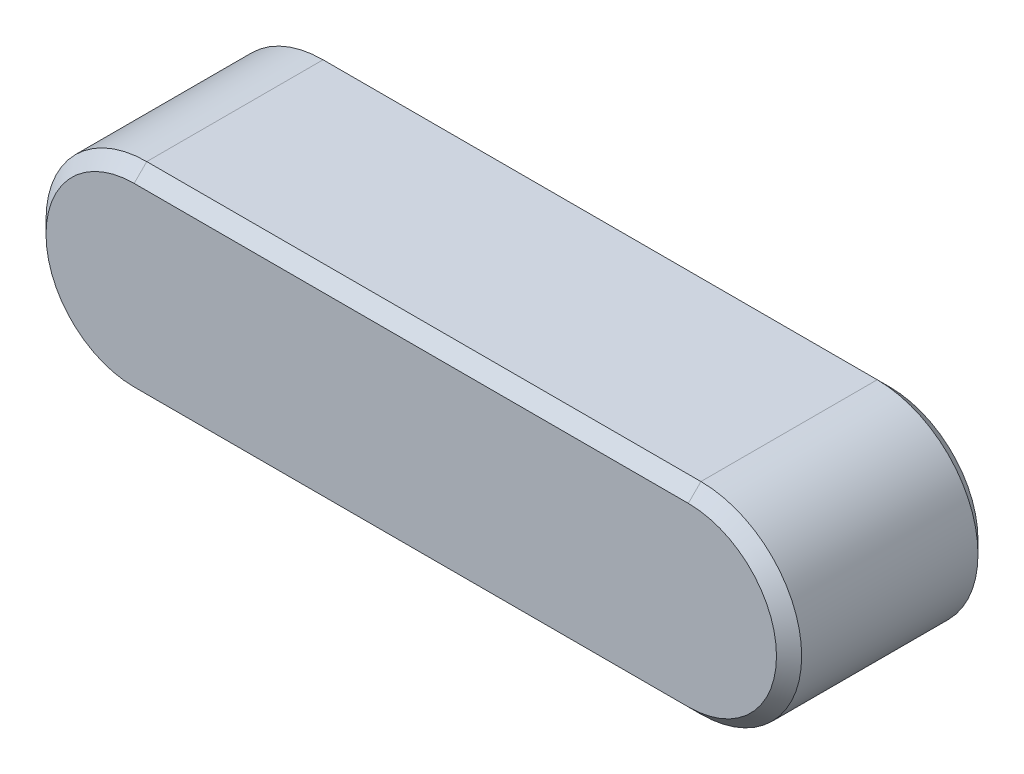
ISO-10303-21;
HEADER;
FILE_DESCRIPTION(('STEP AP214'),'2;1');
FILE_NAME('part.step','',(''),(''),'','','');
FILE_SCHEMA(('AUTOMOTIVE_DESIGN { 1 0 10303 214 1 1 1 1 }'));
ENDSEC;
DATA;
#1=APPLICATION_CONTEXT('core data for automotive mechanical design processes');
#2=APPLICATION_PROTOCOL_DEFINITION('international standard','automotive_design',2000,#1);
#3=PRODUCT_CONTEXT('',#1,'mechanical');
#4=PRODUCT('Part','Part','',(#3));
#5=PRODUCT_RELATED_PRODUCT_CATEGORY('part','',(#4));
#6=PRODUCT_DEFINITION_FORMATION('','',#4);
#7=PRODUCT_DEFINITION_CONTEXT('part definition',#1,'design');
#8=PRODUCT_DEFINITION('design','',#6,#7);
#9=PRODUCT_DEFINITION_SHAPE('','',#8);
#10=(LENGTH_UNIT() NAMED_UNIT(*) SI_UNIT(.MILLI.,.METRE.));
#11=(NAMED_UNIT(*) PLANE_ANGLE_UNIT() SI_UNIT($,.RADIAN.));
#12=(NAMED_UNIT(*) SI_UNIT($,.STERADIAN.) SOLID_ANGLE_UNIT());
#13=UNCERTAINTY_MEASURE_WITH_UNIT(LENGTH_MEASURE(1.E-05),#10,'distance_accuracy_value','');
#14=(GEOMETRIC_REPRESENTATION_CONTEXT(3) GLOBAL_UNCERTAINTY_ASSIGNED_CONTEXT((#13)) GLOBAL_UNIT_ASSIGNED_CONTEXT((#10,
#11,#12)) REPRESENTATION_CONTEXT('',''));
#15=CARTESIAN_POINT('',(0.,0.,0.));
#16=DIRECTION('',(0.,0.,1.));
#17=DIRECTION('',(1.,0.,0.));
#18=AXIS2_PLACEMENT_3D('',#15,#16,#17);
#19=CARTESIAN_POINT('',(0.,0.,8.));
#20=DIRECTION('',(0.,0.,-1.));
#21=DIRECTION('',(-1.,0.,0.));
#22=AXIS2_PLACEMENT_3D('',#19,#20,#21);
#23=CYLINDRICAL_SURFACE('',#22,4.);
#24=DIRECTION('',(0.,0.,-1.));
#25=VECTOR('',#24,1.);
#26=CARTESIAN_POINT('',(0.,4.,8.));
#27=LINE('',#26,#25);
#28=CARTESIAN_POINT('',(0.,4.,7.5));
#29=VERTEX_POINT('',#28);
#30=CARTESIAN_POINT('',(0.,4.,0.500000000000005));
#31=VERTEX_POINT('',#30);
#32=EDGE_CURVE('E169',#29,#31,#27,.T.);
#33=ORIENTED_EDGE('',*,*,#32,.T.);
#34=CARTESIAN_POINT('',(0.,0.,0.500000000000005));
#35=DIRECTION('',(0.,0.,1.));
#36=DIRECTION('',(1.,0.,0.));
#37=AXIS2_PLACEMENT_3D('',#34,#35,#36);
#38=CIRCLE('',#37,4.);
#39=CARTESIAN_POINT('',(0.,-4.,0.500000000000005));
#40=VERTEX_POINT('',#39);
#41=EDGE_CURVE('E125',#31,#40,#38,.T.);
#42=ORIENTED_EDGE('',*,*,#41,.T.);
#43=DIRECTION('',(0.,0.,-1.));
#44=VECTOR('',#43,1.);
#45=CARTESIAN_POINT('',(0.,-4.,8.));
#46=LINE('',#45,#44);
#47=CARTESIAN_POINT('',(0.,-4.,7.5));
#48=VERTEX_POINT('',#47);
#49=EDGE_CURVE('E108',#48,#40,#46,.T.);
#50=ORIENTED_EDGE('',*,*,#49,.F.);
#51=CARTESIAN_POINT('',(0.,0.,7.5));
#52=DIRECTION('',(0.,0.,1.));
#53=DIRECTION('',(1.,0.,0.));
#54=AXIS2_PLACEMENT_3D('',#51,#52,#53);
#55=CIRCLE('',#54,4.);
#56=EDGE_CURVE('E122',#48,#29,#55,.F.);
#57=ORIENTED_EDGE('',*,*,#56,.T.);
#58=EDGE_LOOP('',(#33,#42,#50,#57));
#59=FACE_BOUND('',#58,.T.);
#60=ADVANCED_FACE('F35',(#59),#23,.T.);
#61=CARTESIAN_POINT('',(0.,-4.,8.));
#62=DIRECTION('',(0.,1.,0.));
#63=DIRECTION('',(-1.,0.,0.));
#64=AXIS2_PLACEMENT_3D('',#61,#62,#63);
#65=PLANE('',#64);
#66=ORIENTED_EDGE('',*,*,#49,.T.);
#67=DIRECTION('',(1.,0.,0.));
#68=VECTOR('',#67,1.);
#69=CARTESIAN_POINT('',(0.,-4.,0.500000000000005));
#70=LINE('',#69,#68);
#71=CARTESIAN_POINT('',(22.,-4.,0.500000000000005));
#72=VERTEX_POINT('',#71);
#73=EDGE_CURVE('E115',#40,#72,#70,.T.);
#74=ORIENTED_EDGE('',*,*,#73,.T.);
#75=DIRECTION('',(0.,0.,-1.));
#76=VECTOR('',#75,1.);
#77=CARTESIAN_POINT('',(22.,-4.,8.));
#78=LINE('',#77,#76);
#79=CARTESIAN_POINT('',(22.,-4.,7.5));
#80=VERTEX_POINT('',#79);
#81=EDGE_CURVE('E110',#80,#72,#78,.T.);
#82=ORIENTED_EDGE('',*,*,#81,.F.);
#83=DIRECTION('',(-1.,0.,0.));
#84=VECTOR('',#83,1.);
#85=CARTESIAN_POINT('',(0.,-4.,7.5));
#86=LINE('',#85,#84);
#87=EDGE_CURVE('E105',#80,#48,#86,.T.);
#88=ORIENTED_EDGE('',*,*,#87,.T.);
#89=EDGE_LOOP('',(#66,#74,#82,#88));
#90=FACE_BOUND('',#89,.T.);
#91=ADVANCED_FACE('F107',(#90),#65,.F.);
#92=CARTESIAN_POINT('',(22.,0.,8.));
#93=DIRECTION('',(0.,0.,-1.));
#94=DIRECTION('',(-1.,0.,0.));
#95=AXIS2_PLACEMENT_3D('',#92,#93,#94);
#96=CYLINDRICAL_SURFACE('',#95,4.);
#97=ORIENTED_EDGE('',*,*,#81,.T.);
#98=CARTESIAN_POINT('',(22.,0.,0.500000000000005));
#99=DIRECTION('',(0.,0.,1.));
#100=DIRECTION('',(1.,0.,0.));
#101=AXIS2_PLACEMENT_3D('',#98,#99,#100);
#102=CIRCLE('',#101,4.);
#103=CARTESIAN_POINT('',(22.,4.,0.500000000000005));
#104=VERTEX_POINT('',#103);
#105=EDGE_CURVE('E154',#72,#104,#102,.T.);
#106=ORIENTED_EDGE('',*,*,#105,.T.);
#107=DIRECTION('',(0.,0.,-1.));
#108=VECTOR('',#107,1.);
#109=CARTESIAN_POINT('',(22.,4.,8.));
#110=LINE('',#109,#108);
#111=CARTESIAN_POINT('',(22.,4.,7.5));
#112=VERTEX_POINT('',#111);
#113=EDGE_CURVE('E180',#112,#104,#110,.T.);
#114=ORIENTED_EDGE('',*,*,#113,.F.);
#115=CARTESIAN_POINT('',(22.,0.,7.5));
#116=DIRECTION('',(0.,0.,1.));
#117=DIRECTION('',(1.,0.,0.));
#118=AXIS2_PLACEMENT_3D('',#115,#116,#117);
#119=CIRCLE('',#118,4.);
#120=EDGE_CURVE('E152',#112,#80,#119,.F.);
#121=ORIENTED_EDGE('',*,*,#120,.T.);
#122=EDGE_LOOP('',(#97,#106,#114,#121));
#123=FACE_BOUND('',#122,.T.);
#124=ADVANCED_FACE('F182',(#123),#96,.T.);
#125=CARTESIAN_POINT('',(0.,4.,8.));
#126=DIRECTION('',(0.,-1.,0.));
#127=DIRECTION('',(1.,0.,0.));
#128=AXIS2_PLACEMENT_3D('',#125,#126,#127);
#129=PLANE('',#128);
#130=ORIENTED_EDGE('',*,*,#113,.T.);
#131=DIRECTION('',(-1.,0.,0.));
#132=VECTOR('',#131,1.);
#133=CARTESIAN_POINT('',(0.,4.,0.500000000000005));
#134=LINE('',#133,#132);
#135=EDGE_CURVE('E150',#104,#31,#134,.T.);
#136=ORIENTED_EDGE('',*,*,#135,.T.);
#137=ORIENTED_EDGE('',*,*,#32,.F.);
#138=DIRECTION('',(1.,0.,0.));
#139=VECTOR('',#138,1.);
#140=CARTESIAN_POINT('',(22.,4.,7.5));
#141=LINE('',#140,#139);
#142=EDGE_CURVE('E147',#29,#112,#141,.T.);
#143=ORIENTED_EDGE('',*,*,#142,.T.);
#144=EDGE_LOOP('',(#130,#136,#137,#143));
#145=FACE_BOUND('',#144,.T.);
#146=ADVANCED_FACE('F179',(#145),#129,.F.);
#147=CARTESIAN_POINT('',(0.,0.,8.));
#148=DIRECTION('',(0.,0.,1.));
#149=DIRECTION('',(1.,0.,0.));
#150=AXIS2_PLACEMENT_3D('',#147,#148,#149);
#151=PLANE('',#150);
#152=CARTESIAN_POINT('',(22.,0.,8.));
#153=DIRECTION('',(0.,0.,1.));
#154=DIRECTION('',(1.,0.,0.));
#155=AXIS2_PLACEMENT_3D('',#152,#153,#154);
#156=CIRCLE('',#155,3.5);
#157=CARTESIAN_POINT('',(22.,-3.5,8.));
#158=VERTEX_POINT('',#157);
#159=CARTESIAN_POINT('',(22.,3.5,8.));
#160=VERTEX_POINT('',#159);
#161=EDGE_CURVE('E59',#158,#160,#156,.T.);
#162=ORIENTED_EDGE('',*,*,#161,.T.);
#163=DIRECTION('',(-1.,0.,0.));
#164=VECTOR('',#163,1.);
#165=CARTESIAN_POINT('',(0.,3.5,8.));
#166=LINE('',#165,#164);
#167=CARTESIAN_POINT('',(0.,3.5,8.));
#168=VERTEX_POINT('',#167);
#169=EDGE_CURVE('E11',#160,#168,#166,.T.);
#170=ORIENTED_EDGE('',*,*,#169,.T.);
#171=CARTESIAN_POINT('',(0.,0.,8.));
#172=DIRECTION('',(0.,0.,1.));
#173=DIRECTION('',(1.,0.,0.));
#174=AXIS2_PLACEMENT_3D('',#171,#172,#173);
#175=CIRCLE('',#174,3.5);
#176=CARTESIAN_POINT('',(0.,-3.5,8.));
#177=VERTEX_POINT('',#176);
#178=EDGE_CURVE('E44',#168,#177,#175,.T.);
#179=ORIENTED_EDGE('',*,*,#178,.T.);
#180=DIRECTION('',(1.,0.,0.));
#181=VECTOR('',#180,1.);
#182=CARTESIAN_POINT('',(22.,-3.5,8.));
#183=LINE('',#182,#181);
#184=EDGE_CURVE('E130',#177,#158,#183,.T.);
#185=ORIENTED_EDGE('',*,*,#184,.T.);
#186=EDGE_LOOP('',(#162,#170,#179,#185));
#187=FACE_BOUND('',#186,.T.);
#188=ADVANCED_FACE('F206',(#187),#151,.T.);
#189=CARTESIAN_POINT('',(0.,0.,0.));
#190=DIRECTION('',(0.,0.,1.));
#191=DIRECTION('',(1.,0.,0.));
#192=AXIS2_PLACEMENT_3D('',#189,#190,#191);
#193=PLANE('',#192);
#194=DIRECTION('',(-1.,0.,0.));
#195=VECTOR('',#194,1.);
#196=CARTESIAN_POINT('',(0.,-3.49999999999999,0.));
#197=LINE('',#196,#195);
#198=CARTESIAN_POINT('',(22.,-3.49999999999999,0.));
#199=VERTEX_POINT('',#198);
#200=CARTESIAN_POINT('',(0.,-3.49999999999999,0.));
#201=VERTEX_POINT('',#200);
#202=EDGE_CURVE('E142',#199,#201,#197,.T.);
#203=ORIENTED_EDGE('',*,*,#202,.T.);
#204=CARTESIAN_POINT('',(0.,0.,0.));
#205=DIRECTION('',(0.,0.,1.));
#206=DIRECTION('',(1.,0.,0.));
#207=AXIS2_PLACEMENT_3D('',#204,#205,#206);
#208=CIRCLE('',#207,3.49999999999999);
#209=CARTESIAN_POINT('',(0.,3.49999999999999,0.));
#210=VERTEX_POINT('',#209);
#211=EDGE_CURVE('E116',#201,#210,#208,.F.);
#212=ORIENTED_EDGE('',*,*,#211,.T.);
#213=DIRECTION('',(1.,0.,0.));
#214=VECTOR('',#213,1.);
#215=CARTESIAN_POINT('',(0.,3.49999999999999,0.));
#216=LINE('',#215,#214);
#217=CARTESIAN_POINT('',(22.,3.49999999999999,0.));
#218=VERTEX_POINT('',#217);
#219=EDGE_CURVE('E140',#210,#218,#216,.T.);
#220=ORIENTED_EDGE('',*,*,#219,.T.);
#221=CARTESIAN_POINT('',(22.,0.,0.));
#222=DIRECTION('',(0.,0.,1.));
#223=DIRECTION('',(1.,0.,0.));
#224=AXIS2_PLACEMENT_3D('',#221,#222,#223);
#225=CIRCLE('',#224,3.49999999999999);
#226=EDGE_CURVE('E135',#218,#199,#225,.F.);
#227=ORIENTED_EDGE('',*,*,#226,.T.);
#228=EDGE_LOOP('',(#203,#212,#220,#227));
#229=FACE_BOUND('',#228,.T.);
#230=ADVANCED_FACE('F204',(#229),#193,.F.);
#231=CARTESIAN_POINT('',(22.,0.,0.500000000000005));
#232=DIRECTION('',(0.,0.,1.));
#233=DIRECTION('',(1.,0.,0.));
#234=AXIS2_PLACEMENT_3D('',#231,#232,#233);
#235=CONICAL_SURFACE('',#234,4.,0.785398163397451);
#236=DIRECTION('',(0.,-0.707106781186549,0.707106781186546));
#237=VECTOR('',#236,1.);
#238=CARTESIAN_POINT('',(22.,-3.49999999999999,0.));
#239=LINE('',#238,#237);
#240=EDGE_CURVE('E163',#199,#72,#239,.T.);
#241=ORIENTED_EDGE('',*,*,#240,.F.);
#242=ORIENTED_EDGE('',*,*,#226,.F.);
#243=DIRECTION('',(0.,-0.707106781186549,-0.707106781186546));
#244=VECTOR('',#243,1.);
#245=CARTESIAN_POINT('',(22.,4.,0.500000000000005));
#246=LINE('',#245,#244);
#247=EDGE_CURVE('E166',#104,#218,#246,.T.);
#248=ORIENTED_EDGE('',*,*,#247,.F.);
#249=ORIENTED_EDGE('',*,*,#105,.F.);
#250=EDGE_LOOP('',(#241,#242,#248,#249));
#251=FACE_BOUND('',#250,.T.);
#252=ADVANCED_FACE('F201',(#251),#235,.T.);
#253=CARTESIAN_POINT('',(0.,4.,0.500000000000005));
#254=DIRECTION('',(0.,-0.707106781186546,0.707106781186549));
#255=DIRECTION('',(-1.,0.,0.));
#256=AXIS2_PLACEMENT_3D('',#253,#254,#255);
#257=PLANE('',#256);
#258=ORIENTED_EDGE('',*,*,#247,.T.);
#259=ORIENTED_EDGE('',*,*,#219,.F.);
#260=DIRECTION('',(0.,-0.707106781186549,-0.707106781186546));
#261=VECTOR('',#260,1.);
#262=CARTESIAN_POINT('',(0.,4.,0.500000000000005));
#263=LINE('',#262,#261);
#264=EDGE_CURVE('E161',#31,#210,#263,.T.);
#265=ORIENTED_EDGE('',*,*,#264,.F.);
#266=ORIENTED_EDGE('',*,*,#135,.F.);
#267=EDGE_LOOP('',(#258,#259,#265,#266));
#268=FACE_BOUND('',#267,.T.);
#269=ADVANCED_FACE('F190',(#268),#257,.F.);
#270=CARTESIAN_POINT('',(0.,-4.,0.500000000000005));
#271=DIRECTION('',(0.,0.707106781186546,0.707106781186549));
#272=DIRECTION('',(1.,0.,0.));
#273=AXIS2_PLACEMENT_3D('',#270,#271,#272);
#274=PLANE('',#273);
#275=ORIENTED_EDGE('',*,*,#240,.T.);
#276=ORIENTED_EDGE('',*,*,#73,.F.);
#277=DIRECTION('',(0.,-0.707106781186549,0.707106781186546));
#278=VECTOR('',#277,1.);
#279=CARTESIAN_POINT('',(0.,-3.49999999999999,0.));
#280=LINE('',#279,#278);
#281=EDGE_CURVE('E159',#201,#40,#280,.T.);
#282=ORIENTED_EDGE('',*,*,#281,.F.);
#283=ORIENTED_EDGE('',*,*,#202,.F.);
#284=EDGE_LOOP('',(#275,#276,#282,#283));
#285=FACE_BOUND('',#284,.T.);
#286=ADVANCED_FACE('F198',(#285),#274,.F.);
#287=CARTESIAN_POINT('',(0.,0.,0.500000000000005));
#288=DIRECTION('',(0.,0.,1.));
#289=DIRECTION('',(1.,0.,0.));
#290=AXIS2_PLACEMENT_3D('',#287,#288,#289);
#291=CONICAL_SURFACE('',#290,4.,0.785398163397451);
#292=ORIENTED_EDGE('',*,*,#264,.T.);
#293=ORIENTED_EDGE('',*,*,#211,.F.);
#294=ORIENTED_EDGE('',*,*,#281,.T.);
#295=ORIENTED_EDGE('',*,*,#41,.F.);
#296=EDGE_LOOP('',(#292,#293,#294,#295));
#297=FACE_BOUND('',#296,.T.);
#298=ADVANCED_FACE('F193',(#297),#291,.T.);
#299=CARTESIAN_POINT('',(0.,-3.5,8.));
#300=DIRECTION('',(0.,-0.70710678118655,0.707106781186545));
#301=DIRECTION('',(-1.,0.,0.));
#302=AXIS2_PLACEMENT_3D('',#299,#300,#301);
#303=PLANE('',#302);
#304=DIRECTION('',(0.,0.707106781186545,0.70710678118655));
#305=VECTOR('',#304,1.);
#306=CARTESIAN_POINT('',(0.,-4.,7.5));
#307=LINE('',#306,#305);
#308=EDGE_CURVE('E129',#48,#177,#307,.T.);
#309=ORIENTED_EDGE('',*,*,#308,.F.);
#310=ORIENTED_EDGE('',*,*,#87,.F.);
#311=DIRECTION('',(0.,-0.707106781186545,-0.70710678118655));
#312=VECTOR('',#311,1.);
#313=CARTESIAN_POINT('',(22.,-3.5,8.));
#314=LINE('',#313,#312);
#315=EDGE_CURVE('E39',#158,#80,#314,.T.);
#316=ORIENTED_EDGE('',*,*,#315,.F.);
#317=ORIENTED_EDGE('',*,*,#184,.F.);
#318=EDGE_LOOP('',(#309,#310,#316,#317));
#319=FACE_BOUND('',#318,.T.);
#320=ADVANCED_FACE('F37',(#319),#303,.T.);
#321=CARTESIAN_POINT('',(22.,0.,8.));
#322=DIRECTION('',(0.,0.,-1.));
#323=DIRECTION('',(-1.,0.,0.));
#324=AXIS2_PLACEMENT_3D('',#321,#322,#323);
#325=CONICAL_SURFACE('',#324,3.5,0.785398163397445);
#326=ORIENTED_EDGE('',*,*,#315,.T.);
#327=ORIENTED_EDGE('',*,*,#120,.F.);
#328=DIRECTION('',(0.,0.707106781186545,-0.70710678118655));
#329=VECTOR('',#328,1.);
#330=CARTESIAN_POINT('',(22.,3.5,8.));
#331=LINE('',#330,#329);
#332=EDGE_CURVE('E132',#160,#112,#331,.T.);
#333=ORIENTED_EDGE('',*,*,#332,.F.);
#334=ORIENTED_EDGE('',*,*,#161,.F.);
#335=EDGE_LOOP('',(#326,#327,#333,#334));
#336=FACE_BOUND('',#335,.T.);
#337=ADVANCED_FACE('F174',(#336),#325,.T.);
#338=CARTESIAN_POINT('',(0.,0.,8.));
#339=DIRECTION('',(0.,0.,-1.));
#340=DIRECTION('',(-1.,0.,0.));
#341=AXIS2_PLACEMENT_3D('',#338,#339,#340);
#342=CONICAL_SURFACE('',#341,3.5,0.785398163397445);
#343=ORIENTED_EDGE('',*,*,#308,.T.);
#344=ORIENTED_EDGE('',*,*,#178,.F.);
#345=DIRECTION('',(0.,-0.707106781186545,0.70710678118655));
#346=VECTOR('',#345,1.);
#347=CARTESIAN_POINT('',(0.,4.,7.5));
#348=LINE('',#347,#346);
#349=EDGE_CURVE('E52',#29,#168,#348,.T.);
#350=ORIENTED_EDGE('',*,*,#349,.F.);
#351=ORIENTED_EDGE('',*,*,#56,.F.);
#352=EDGE_LOOP('',(#343,#344,#350,#351));
#353=FACE_BOUND('',#352,.T.);
#354=ADVANCED_FACE('F133',(#353),#342,.T.);
#355=CARTESIAN_POINT('',(0.,3.5,8.));
#356=DIRECTION('',(0.,0.70710678118655,0.707106781186545));
#357=DIRECTION('',(1.,0.,0.));
#358=AXIS2_PLACEMENT_3D('',#355,#356,#357);
#359=PLANE('',#358);
#360=ORIENTED_EDGE('',*,*,#332,.T.);
#361=ORIENTED_EDGE('',*,*,#142,.F.);
#362=ORIENTED_EDGE('',*,*,#349,.T.);
#363=ORIENTED_EDGE('',*,*,#169,.F.);
#364=EDGE_LOOP('',(#360,#361,#362,#363));
#365=FACE_BOUND('',#364,.T.);
#366=ADVANCED_FACE('F172',(#365),#359,.T.);
#367=CLOSED_SHELL('',(#60,#91,#124,#146,#188,#230,#252,#269,#286,#298,#320,#337,#354,#366));
#368=MANIFOLD_SOLID_BREP('B2',#367);
#369=ADVANCED_BREP_SHAPE_REPRESENTATION('',(#18,#368),#14);
#370=SHAPE_DEFINITION_REPRESENTATION(#9,#369);
ENDSEC;
END-ISO-10303-21;
